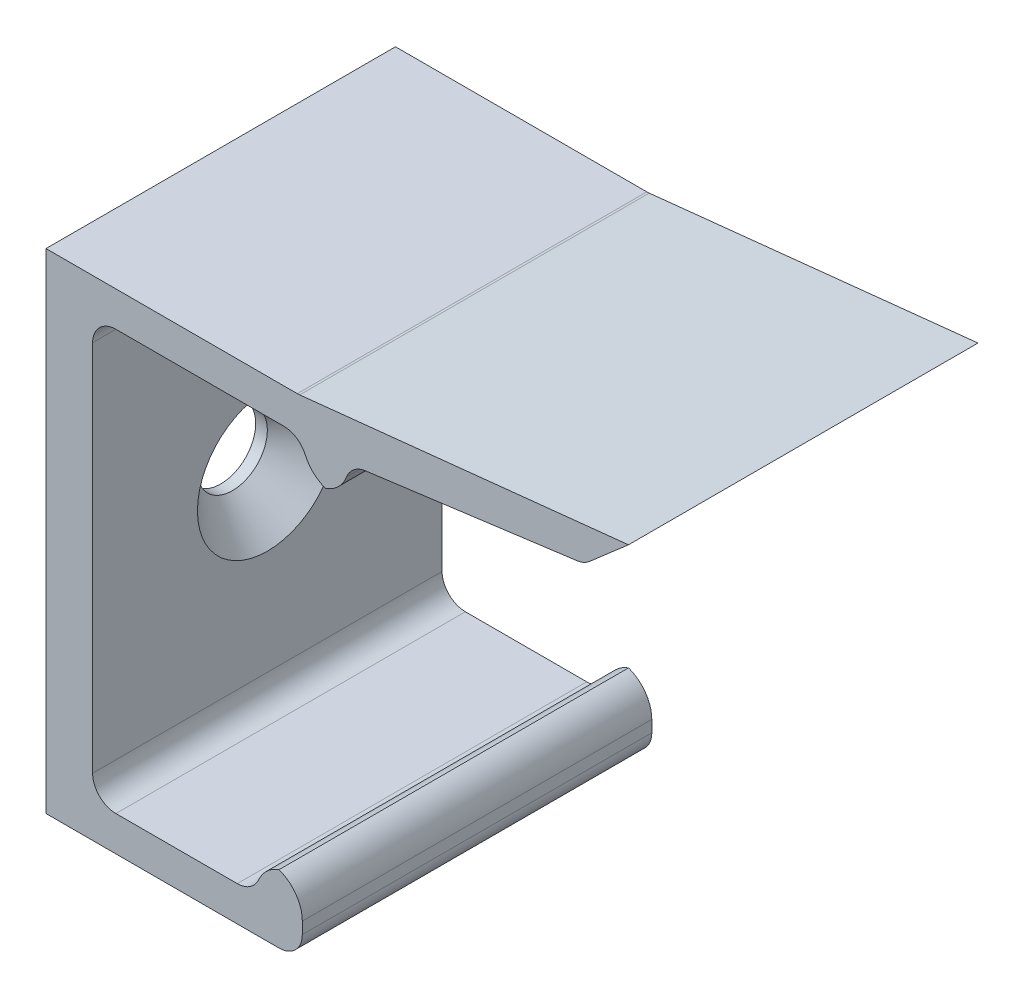
ISO-10303-21;
HEADER;
FILE_DESCRIPTION(('STEP AP214'),'2;1');
FILE_NAME('part.step','',(''),(''),'','','');
FILE_SCHEMA(('AUTOMOTIVE_DESIGN { 1 0 10303 214 1 1 1 1 }'));
ENDSEC;
DATA;
#1=APPLICATION_CONTEXT('core data for automotive mechanical design processes');
#2=APPLICATION_PROTOCOL_DEFINITION('international standard','automotive_design',2000,#1);
#3=PRODUCT_CONTEXT('',#1,'mechanical');
#4=PRODUCT('Part','Part','',(#3));
#5=PRODUCT_RELATED_PRODUCT_CATEGORY('part','',(#4));
#6=PRODUCT_DEFINITION_FORMATION('','',#4);
#7=PRODUCT_DEFINITION_CONTEXT('part definition',#1,'design');
#8=PRODUCT_DEFINITION('design','',#6,#7);
#9=PRODUCT_DEFINITION_SHAPE('','',#8);
#10=(LENGTH_UNIT() NAMED_UNIT(*) SI_UNIT(.MILLI.,.METRE.));
#11=(NAMED_UNIT(*) PLANE_ANGLE_UNIT() SI_UNIT($,.RADIAN.));
#12=(NAMED_UNIT(*) SI_UNIT($,.STERADIAN.) SOLID_ANGLE_UNIT());
#13=UNCERTAINTY_MEASURE_WITH_UNIT(LENGTH_MEASURE(1.E-05),#10,'distance_accuracy_value','');
#14=(GEOMETRIC_REPRESENTATION_CONTEXT(3) GLOBAL_UNCERTAINTY_ASSIGNED_CONTEXT((#13)) GLOBAL_UNIT_ASSIGNED_CONTEXT((#10,
#11,#12)) REPRESENTATION_CONTEXT('',''));
#15=CARTESIAN_POINT('',(0.,0.,0.));
#16=DIRECTION('',(0.,0.,1.));
#17=DIRECTION('',(1.,0.,0.));
#18=AXIS2_PLACEMENT_3D('',#15,#16,#17);
#19=CARTESIAN_POINT('',(2.,1.5,15.));
#20=DIRECTION('',(-1.,0.,0.));
#21=DIRECTION('',(0.,-1.,0.));
#22=AXIS2_PLACEMENT_3D('',#19,#20,#21);
#23=PLANE('',#22);
#24=CARTESIAN_POINT('',(2.,10.,7.5));
#25=DIRECTION('',(-1.,0.,0.));
#26=DIRECTION('',(0.,-1.,0.));
#27=AXIS2_PLACEMENT_3D('',#24,#25,#26);
#28=CIRCLE('',#27,2.99999999999999);
#29=CARTESIAN_POINT('',(2.,7.00000000000001,7.5));
#30=VERTEX_POINT('',#29);
#31=EDGE_CURVE('E208',#30,#30,#28,.T.);
#32=ORIENTED_EDGE('',*,*,#31,.T.);
#33=EDGE_LOOP('',(#32));
#34=FACE_BOUND('',#33,.T.);
#35=DIRECTION('',(0.,1.,0.));
#36=VECTOR('',#35,1.);
#37=CARTESIAN_POINT('',(2.,1.5,15.));
#38=LINE('',#37,#36);
#39=CARTESIAN_POINT('',(2.,2.5,15.));
#40=VERTEX_POINT('',#39);
#41=CARTESIAN_POINT('',(2.,18.5,15.));
#42=VERTEX_POINT('',#41);
#43=EDGE_CURVE('E360',#40,#42,#38,.T.);
#44=ORIENTED_EDGE('',*,*,#43,.F.);
#45=DIRECTION('',(0.,0.,-1.));
#46=VECTOR('',#45,1.);
#47=CARTESIAN_POINT('',(2.,2.5,0.));
#48=LINE('',#47,#46);
#49=CARTESIAN_POINT('',(2.,2.5,0.));
#50=VERTEX_POINT('',#49);
#51=EDGE_CURVE('E268',#40,#50,#48,.T.);
#52=ORIENTED_EDGE('',*,*,#51,.T.);
#53=DIRECTION('',(0.,1.,0.));
#54=VECTOR('',#53,1.);
#55=CARTESIAN_POINT('',(2.,1.5,0.));
#56=LINE('',#55,#54);
#57=CARTESIAN_POINT('',(2.,18.5,0.));
#58=VERTEX_POINT('',#57);
#59=EDGE_CURVE('E339',#50,#58,#56,.T.);
#60=ORIENTED_EDGE('',*,*,#59,.T.);
#61=DIRECTION('',(0.,0.,-1.));
#62=VECTOR('',#61,1.);
#63=CARTESIAN_POINT('',(2.,18.5,15.));
#64=LINE('',#63,#62);
#65=EDGE_CURVE('E266',#58,#42,#64,.F.);
#66=ORIENTED_EDGE('',*,*,#65,.T.);
#67=EDGE_LOOP('',(#44,#52,#60,#66));
#68=FACE_BOUND('',#67,.T.);
#69=ADVANCED_FACE('F33',(#34,#68),#23,.F.);
#70=CARTESIAN_POINT('',(2.,19.5,15.));
#71=DIRECTION('',(0.,1.,0.));
#72=DIRECTION('',(0.,0.,1.));
#73=AXIS2_PLACEMENT_3D('',#70,#71,#72);
#74=PLANE('',#73);
#75=DIRECTION('',(1.,0.,0.));
#76=VECTOR('',#75,1.);
#77=CARTESIAN_POINT('',(2.,19.5,0.));
#78=LINE('',#77,#76);
#79=CARTESIAN_POINT('',(3.,19.5,0.));
#80=VERTEX_POINT('',#79);
#81=CARTESIAN_POINT('',(10.2087121525221,19.5,0.));
#82=VERTEX_POINT('',#81);
#83=EDGE_CURVE('E334',#80,#82,#78,.T.);
#84=ORIENTED_EDGE('',*,*,#83,.T.);
#85=DIRECTION('',(0.,0.,-1.));
#86=VECTOR('',#85,1.);
#87=CARTESIAN_POINT('',(10.2087121525221,19.5,15.));
#88=LINE('',#87,#86);
#89=CARTESIAN_POINT('',(10.2087121525221,19.5,15.));
#90=VERTEX_POINT('',#89);
#91=EDGE_CURVE('E303',#82,#90,#88,.F.);
#92=ORIENTED_EDGE('',*,*,#91,.T.);
#93=DIRECTION('',(1.,0.,0.));
#94=VECTOR('',#93,1.);
#95=CARTESIAN_POINT('',(2.,19.5,15.));
#96=LINE('',#95,#94);
#97=CARTESIAN_POINT('',(3.,19.5,15.));
#98=VERTEX_POINT('',#97);
#99=EDGE_CURVE('E321',#98,#90,#96,.T.);
#100=ORIENTED_EDGE('',*,*,#99,.F.);
#101=DIRECTION('',(0.,0.,-1.));
#102=VECTOR('',#101,1.);
#103=CARTESIAN_POINT('',(3.,19.5,0.));
#104=LINE('',#103,#102);
#105=EDGE_CURVE('E274',#98,#80,#104,.T.);
#106=ORIENTED_EDGE('',*,*,#105,.T.);
#107=EDGE_LOOP('',(#84,#92,#100,#106));
#108=FACE_BOUND('',#107,.T.);
#109=ADVANCED_FACE('F336',(#108),#74,.F.);
#110=CARTESIAN_POINT('',(13.,19.5,15.));
#111=DIRECTION('',(-0.130853953425096,0.991401655673937,0.));
#112=DIRECTION('',(-0.991401655673937,-0.130853953425096,0.));
#113=AXIS2_PLACEMENT_3D('',#110,#111,#112);
#114=PLANE('',#113);
#115=DIRECTION('',(0.991401655673937,0.130853953425096,0.));
#116=VECTOR('',#115,1.);
#117=CARTESIAN_POINT('',(13.,19.5,15.));
#118=LINE('',#117,#116);
#119=CARTESIAN_POINT('',(13.7020110590844,19.59265762459,15.));
#120=VERTEX_POINT('',#119);
#121=CARTESIAN_POINT('',(22.7966760393131,20.7930518955989,15.));
#122=VERTEX_POINT('',#121);
#123=EDGE_CURVE('E193',#120,#122,#118,.T.);
#124=ORIENTED_EDGE('',*,*,#123,.F.);
#125=DIRECTION('',(0.,0.,-1.));
#126=VECTOR('',#125,1.);
#127=CARTESIAN_POINT('',(13.7020110590844,19.59265762459,15.));
#128=LINE('',#127,#126);
#129=CARTESIAN_POINT('',(13.7020110590844,19.59265762459,0.));
#130=VERTEX_POINT('',#129);
#131=EDGE_CURVE('E295',#120,#130,#128,.T.);
#132=ORIENTED_EDGE('',*,*,#131,.T.);
#133=DIRECTION('',(0.991401655673937,0.130853953425096,0.));
#134=VECTOR('',#133,1.);
#135=CARTESIAN_POINT('',(13.,19.5,0.));
#136=LINE('',#135,#134);
#137=CARTESIAN_POINT('',(22.7966760393131,20.7930518955989,0.));
#138=VERTEX_POINT('',#137);
#139=EDGE_CURVE('E338',#130,#138,#136,.T.);
#140=ORIENTED_EDGE('',*,*,#139,.T.);
#141=DIRECTION('',(0.,0.,-1.));
#142=VECTOR('',#141,1.);
#143=CARTESIAN_POINT('',(22.7966760393131,20.7930518955989,15.));
#144=LINE('',#143,#142);
#145=EDGE_CURVE('E279',#138,#122,#144,.F.);
#146=ORIENTED_EDGE('',*,*,#145,.T.);
#147=EDGE_LOOP('',(#124,#132,#140,#146));
#148=FACE_BOUND('',#147,.T.);
#149=ADVANCED_FACE('F407',(#148),#114,.F.);
#150=CARTESIAN_POINT('',(23.0948753583367,20.8324108774803,15.));
#151=DIRECTION('',(-0.656059028990508,0.754709580222771,0.));
#152=DIRECTION('',(-0.754709580222771,-0.656059028990508,0.));
#153=AXIS2_PLACEMENT_3D('',#150,#151,#152);
#154=PLANE('',#153);
#155=DIRECTION('',(0.754709580222771,0.656059028990508,0.));
#156=VECTOR('',#155,1.);
#157=CARTESIAN_POINT('',(23.0948753583367,20.8324108774803,15.));
#158=LINE('',#157,#156);
#159=CARTESIAN_POINT('',(23.3218811148785,21.02974397105,15.));
#160=VERTEX_POINT('',#159);
#161=CARTESIAN_POINT('',(25.,22.4885104623651,15.));
#162=VERTEX_POINT('',#161);
#163=EDGE_CURVE('E181',#160,#162,#158,.T.);
#164=ORIENTED_EDGE('',*,*,#163,.F.);
#165=DIRECTION('',(0.,0.,-1.));
#166=VECTOR('',#165,1.);
#167=CARTESIAN_POINT('',(23.3218811148785,21.02974397105,15.));
#168=LINE('',#167,#166);
#169=CARTESIAN_POINT('',(23.3218811148785,21.02974397105,0.));
#170=VERTEX_POINT('',#169);
#171=EDGE_CURVE('E277',#160,#170,#168,.T.);
#172=ORIENTED_EDGE('',*,*,#171,.T.);
#173=DIRECTION('',(0.754709580222771,0.656059028990508,0.));
#174=VECTOR('',#173,1.);
#175=CARTESIAN_POINT('',(23.0948753583367,20.8324108774803,0.));
#176=LINE('',#175,#174);
#177=CARTESIAN_POINT('',(25.,22.4885104623651,0.));
#178=VERTEX_POINT('',#177);
#179=EDGE_CURVE('E206',#170,#178,#176,.T.);
#180=ORIENTED_EDGE('',*,*,#179,.T.);
#181=DIRECTION('',(0.,0.,-1.));
#182=VECTOR('',#181,1.);
#183=CARTESIAN_POINT('',(25.,22.4885104623651,15.));
#184=LINE('',#183,#182);
#185=EDGE_CURVE('E199',#162,#178,#184,.T.);
#186=ORIENTED_EDGE('',*,*,#185,.F.);
#187=EDGE_LOOP('',(#164,#172,#180,#186));
#188=FACE_BOUND('',#187,.T.);
#189=ADVANCED_FACE('F204',(#188),#154,.F.);
#190=CARTESIAN_POINT('',(10.8377689671354,21.,15.));
#191=DIRECTION('',(-0.104528463267654,0.994521895368273,0.));
#192=DIRECTION('',(-0.994521895368273,-0.104528463267654,0.));
#193=AXIS2_PLACEMENT_3D('',#190,#191,#192);
#194=PLANE('',#193);
#195=DIRECTION('',(0.994521895368273,0.104528463267654,0.));
#196=VECTOR('',#195,1.);
#197=CARTESIAN_POINT('',(10.8377689671354,21.,0.));
#198=LINE('',#197,#196);
#199=CARTESIAN_POINT('',(10.88988965112,21.0054781046317,0.));
#200=VERTEX_POINT('',#199);
#201=EDGE_CURVE('E347',#200,#178,#198,.T.);
#202=ORIENTED_EDGE('',*,*,#201,.F.);
#203=DIRECTION('',(0.,0.,-1.));
#204=VECTOR('',#203,1.);
#205=CARTESIAN_POINT('',(10.88988965112,21.0054781046317,15.));
#206=LINE('',#205,#204);
#207=CARTESIAN_POINT('',(10.88988965112,21.0054781046317,15.));
#208=VERTEX_POINT('',#207);
#209=EDGE_CURVE('E201',#200,#208,#206,.F.);
#210=ORIENTED_EDGE('',*,*,#209,.T.);
#211=DIRECTION('',(0.994521895368273,0.104528463267654,0.));
#212=VECTOR('',#211,1.);
#213=CARTESIAN_POINT('',(10.8377689671354,21.,15.));
#214=LINE('',#213,#212);
#215=EDGE_CURVE('E185',#208,#162,#214,.T.);
#216=ORIENTED_EDGE('',*,*,#215,.T.);
#217=ORIENTED_EDGE('',*,*,#185,.T.);
#218=EDGE_LOOP('',(#202,#210,#216,#217));
#219=FACE_BOUND('',#218,.T.);
#220=ADVANCED_FACE('F198',(#219),#194,.T.);
#221=CARTESIAN_POINT('',(0.,21.,15.));
#222=DIRECTION('',(0.,1.,0.));
#223=DIRECTION('',(0.,0.,1.));
#224=AXIS2_PLACEMENT_3D('',#221,#222,#223);
#225=PLANE('',#224);
#226=DIRECTION('',(1.,0.,0.));
#227=VECTOR('',#226,1.);
#228=CARTESIAN_POINT('',(0.,21.,15.));
#229=LINE('',#228,#227);
#230=CARTESIAN_POINT('',(0.,21.,15.));
#231=VERTEX_POINT('',#230);
#232=CARTESIAN_POINT('',(10.7853611878524,21.,15.));
#233=VERTEX_POINT('',#232);
#234=EDGE_CURVE('E202',#231,#233,#229,.T.);
#235=ORIENTED_EDGE('',*,*,#234,.T.);
#236=DIRECTION('',(0.,0.,-1.));
#237=VECTOR('',#236,1.);
#238=CARTESIAN_POINT('',(10.7853611878524,21.,0.));
#239=LINE('',#238,#237);
#240=CARTESIAN_POINT('',(10.7853611878524,21.,0.));
#241=VERTEX_POINT('',#240);
#242=EDGE_CURVE('E242',#233,#241,#239,.T.);
#243=ORIENTED_EDGE('',*,*,#242,.T.);
#244=DIRECTION('',(1.,0.,0.));
#245=VECTOR('',#244,1.);
#246=CARTESIAN_POINT('',(0.,21.,0.));
#247=LINE('',#246,#245);
#248=CARTESIAN_POINT('',(0.,21.,0.));
#249=VERTEX_POINT('',#248);
#250=EDGE_CURVE('E349',#249,#241,#247,.T.);
#251=ORIENTED_EDGE('',*,*,#250,.F.);
#252=DIRECTION('',(0.,0.,-1.));
#253=VECTOR('',#252,1.);
#254=CARTESIAN_POINT('',(0.,21.,15.));
#255=LINE('',#254,#253);
#256=EDGE_CURVE('E209',#231,#249,#255,.T.);
#257=ORIENTED_EDGE('',*,*,#256,.F.);
#258=EDGE_LOOP('',(#235,#243,#251,#257));
#259=FACE_BOUND('',#258,.T.);
#260=ADVANCED_FACE('F480',(#259),#225,.T.);
#261=CARTESIAN_POINT('',(0.,21.,15.));
#262=DIRECTION('',(1.,0.,0.));
#263=DIRECTION('',(0.,1.,0.));
#264=AXIS2_PLACEMENT_3D('',#261,#262,#263);
#265=PLANE('',#264);
#266=CARTESIAN_POINT('',(0.,10.,7.5));
#267=DIRECTION('',(1.,0.,0.));
#268=DIRECTION('',(0.,1.,0.));
#269=AXIS2_PLACEMENT_3D('',#266,#267,#268);
#270=CIRCLE('',#269,1.5);
#271=CARTESIAN_POINT('',(0.,11.5,7.5));
#272=VERTEX_POINT('',#271);
#273=EDGE_CURVE('E246',#272,#272,#270,.T.);
#274=ORIENTED_EDGE('',*,*,#273,.T.);
#275=EDGE_LOOP('',(#274));
#276=FACE_BOUND('',#275,.T.);
#277=DIRECTION('',(0.,-1.,0.));
#278=VECTOR('',#277,1.);
#279=CARTESIAN_POINT('',(0.,21.,0.));
#280=LINE('',#279,#278);
#281=CARTESIAN_POINT('',(0.,0.,0.));
#282=VERTEX_POINT('',#281);
#283=EDGE_CURVE('E352',#249,#282,#280,.T.);
#284=ORIENTED_EDGE('',*,*,#283,.T.);
#285=DIRECTION('',(0.,0.,-1.));
#286=VECTOR('',#285,1.);
#287=CARTESIAN_POINT('',(0.,0.,15.));
#288=LINE('',#287,#286);
#289=CARTESIAN_POINT('',(0.,0.,15.));
#290=VERTEX_POINT('',#289);
#291=EDGE_CURVE('E214',#290,#282,#288,.T.);
#292=ORIENTED_EDGE('',*,*,#291,.F.);
#293=DIRECTION('',(0.,-1.,0.));
#294=VECTOR('',#293,1.);
#295=CARTESIAN_POINT('',(0.,21.,15.));
#296=LINE('',#295,#294);
#297=EDGE_CURVE('E373',#231,#290,#296,.T.);
#298=ORIENTED_EDGE('',*,*,#297,.F.);
#299=ORIENTED_EDGE('',*,*,#256,.T.);
#300=EDGE_LOOP('',(#284,#292,#298,#299));
#301=FACE_BOUND('',#300,.T.);
#302=ADVANCED_FACE('F384',(#276,#301),#265,.F.);
#303=CARTESIAN_POINT('',(0.,0.,15.));
#304=DIRECTION('',(0.,1.,0.));
#305=DIRECTION('',(0.,0.,1.));
#306=AXIS2_PLACEMENT_3D('',#303,#304,#305);
#307=PLANE('',#306);
#308=DIRECTION('',(1.,0.,0.));
#309=VECTOR('',#308,1.);
#310=CARTESIAN_POINT('',(0.,0.,0.));
#311=LINE('',#310,#309);
#312=CARTESIAN_POINT('',(9.99999999999999,0.,0.));
#313=VERTEX_POINT('',#312);
#314=EDGE_CURVE('E354',#282,#313,#311,.T.);
#315=ORIENTED_EDGE('',*,*,#314,.T.);
#316=DIRECTION('',(0.,0.,-1.));
#317=VECTOR('',#316,1.);
#318=CARTESIAN_POINT('',(9.99999999999999,0.,15.));
#319=LINE('',#318,#317);
#320=CARTESIAN_POINT('',(9.99999999999999,0.,15.));
#321=VERTEX_POINT('',#320);
#322=EDGE_CURVE('E261',#313,#321,#319,.F.);
#323=ORIENTED_EDGE('',*,*,#322,.T.);
#324=DIRECTION('',(1.,0.,0.));
#325=VECTOR('',#324,1.);
#326=CARTESIAN_POINT('',(0.,0.,15.));
#327=LINE('',#326,#325);
#328=EDGE_CURVE('E369',#290,#321,#327,.T.);
#329=ORIENTED_EDGE('',*,*,#328,.F.);
#330=ORIENTED_EDGE('',*,*,#291,.T.);
#331=EDGE_LOOP('',(#315,#323,#329,#330));
#332=FACE_BOUND('',#331,.T.);
#333=ADVANCED_FACE('F472',(#332),#307,.F.);
#334=CARTESIAN_POINT('',(11.,0.,15.));
#335=DIRECTION('',(-1.,0.,0.));
#336=DIRECTION('',(0.,-1.,0.));
#337=AXIS2_PLACEMENT_3D('',#334,#335,#336);
#338=PLANE('',#337);
#339=DIRECTION('',(0.,1.,0.));
#340=VECTOR('',#339,1.);
#341=CARTESIAN_POINT('',(11.,0.,15.));
#342=LINE('',#341,#340);
#343=CARTESIAN_POINT('',(11.,1.,15.));
#344=VERTEX_POINT('',#343);
#345=CARTESIAN_POINT('',(11.,1.5,15.));
#346=VERTEX_POINT('',#345);
#347=EDGE_CURVE('E367',#344,#346,#342,.T.);
#348=ORIENTED_EDGE('',*,*,#347,.F.);
#349=DIRECTION('',(0.,0.,-1.));
#350=VECTOR('',#349,1.);
#351=CARTESIAN_POINT('',(11.,1.,15.));
#352=LINE('',#351,#350);
#353=CARTESIAN_POINT('',(11.,1.,0.));
#354=VERTEX_POINT('',#353);
#355=EDGE_CURVE('E253',#344,#354,#352,.T.);
#356=ORIENTED_EDGE('',*,*,#355,.T.);
#357=DIRECTION('',(0.,1.,0.));
#358=VECTOR('',#357,1.);
#359=CARTESIAN_POINT('',(11.,0.,0.));
#360=LINE('',#359,#358);
#361=CARTESIAN_POINT('',(11.,1.5,0.));
#362=VERTEX_POINT('',#361);
#363=EDGE_CURVE('E357',#354,#362,#360,.T.);
#364=ORIENTED_EDGE('',*,*,#363,.T.);
#365=DIRECTION('',(0.,0.,-1.));
#366=VECTOR('',#365,1.);
#367=CARTESIAN_POINT('',(11.,1.5,15.));
#368=LINE('',#367,#366);
#369=EDGE_CURVE('E239',#362,#346,#368,.F.);
#370=ORIENTED_EDGE('',*,*,#369,.T.);
#371=EDGE_LOOP('',(#348,#356,#364,#370));
#372=FACE_BOUND('',#371,.T.);
#373=ADVANCED_FACE('F466',(#372),#338,.F.);
#374=CARTESIAN_POINT('',(9.,1.5,15.));
#375=DIRECTION('',(0.,-1.,0.));
#376=DIRECTION('',(1.,0.,0.));
#377=AXIS2_PLACEMENT_3D('',#374,#375,#376);
#378=PLANE('',#377);
#379=DIRECTION('',(-1.,0.,0.));
#380=VECTOR('',#379,1.);
#381=CARTESIAN_POINT('',(9.,1.5,15.));
#382=LINE('',#381,#380);
#383=CARTESIAN_POINT('',(8.20871215252208,1.5,15.));
#384=VERTEX_POINT('',#383);
#385=CARTESIAN_POINT('',(3.,1.5,15.));
#386=VERTEX_POINT('',#385);
#387=EDGE_CURVE('E362',#384,#386,#382,.T.);
#388=ORIENTED_EDGE('',*,*,#387,.F.);
#389=DIRECTION('',(0.,0.,-1.));
#390=VECTOR('',#389,1.);
#391=CARTESIAN_POINT('',(8.20871215252208,1.5,15.));
#392=LINE('',#391,#390);
#393=CARTESIAN_POINT('',(8.20871215252208,1.5,0.));
#394=VERTEX_POINT('',#393);
#395=EDGE_CURVE('E305',#384,#394,#392,.T.);
#396=ORIENTED_EDGE('',*,*,#395,.T.);
#397=DIRECTION('',(-1.,0.,0.));
#398=VECTOR('',#397,1.);
#399=CARTESIAN_POINT('',(9.,1.5,0.));
#400=LINE('',#399,#398);
#401=CARTESIAN_POINT('',(3.,1.5,0.));
#402=VERTEX_POINT('',#401);
#403=EDGE_CURVE('E359',#394,#402,#400,.T.);
#404=ORIENTED_EDGE('',*,*,#403,.T.);
#405=DIRECTION('',(0.,0.,-1.));
#406=VECTOR('',#405,1.);
#407=CARTESIAN_POINT('',(3.,1.5,15.));
#408=LINE('',#407,#406);
#409=EDGE_CURVE('E271',#402,#386,#408,.F.);
#410=ORIENTED_EDGE('',*,*,#409,.T.);
#411=EDGE_LOOP('',(#388,#396,#404,#410));
#412=FACE_BOUND('',#411,.T.);
#413=ADVANCED_FACE('F457',(#412),#378,.F.);
#414=CARTESIAN_POINT('',(0.,0.,15.));
#415=DIRECTION('',(0.,0.,-1.));
#416=DIRECTION('',(-1.,0.,0.));
#417=AXIS2_PLACEMENT_3D('',#414,#415,#416);
#418=PLANE('',#417);
#419=ORIENTED_EDGE('',*,*,#328,.T.);
#420=CARTESIAN_POINT('',(9.99999999999999,1.,15.));
#421=DIRECTION('',(0.,0.,-1.));
#422=DIRECTION('',(-1.,0.,0.));
#423=AXIS2_PLACEMENT_3D('',#420,#421,#422);
#424=CIRCLE('',#423,1.);
#425=EDGE_CURVE('E264',#321,#344,#424,.F.);
#426=ORIENTED_EDGE('',*,*,#425,.T.);
#427=ORIENTED_EDGE('',*,*,#347,.T.);
#428=CARTESIAN_POINT('',(9.49999999999999,1.5,15.));
#429=DIRECTION('',(0.,0.,-1.));
#430=DIRECTION('',(-1.,0.,0.));
#431=AXIS2_PLACEMENT_3D('',#428,#429,#430);
#432=CIRCLE('',#431,1.5);
#433=CARTESIAN_POINT('',(9.99999999999999,2.91421356237309,15.));
#434=VERTEX_POINT('',#433);
#435=EDGE_CURVE('E235',#346,#434,#432,.F.);
#436=ORIENTED_EDGE('',*,*,#435,.T.);
#437=CARTESIAN_POINT('',(10.5,1.5,15.));
#438=DIRECTION('',(0.,0.,-1.));
#439=DIRECTION('',(-1.,0.,0.));
#440=AXIS2_PLACEMENT_3D('',#437,#438,#439);
#441=CIRCLE('',#440,1.5);
#442=CARTESIAN_POINT('',(9.12522729151324,2.1,15.));
#443=VERTEX_POINT('',#442);
#444=EDGE_CURVE('E237',#434,#443,#441,.F.);
#445=ORIENTED_EDGE('',*,*,#444,.T.);
#446=CARTESIAN_POINT('',(8.20871215252208,2.5,15.));
#447=DIRECTION('',(0.,0.,-1.));
#448=DIRECTION('',(-1.,0.,0.));
#449=AXIS2_PLACEMENT_3D('',#446,#447,#448);
#450=CIRCLE('',#449,1.);
#451=EDGE_CURVE('E11',#443,#384,#450,.T.);
#452=ORIENTED_EDGE('',*,*,#451,.T.);
#453=ORIENTED_EDGE('',*,*,#387,.T.);
#454=CARTESIAN_POINT('',(3.,2.5,15.));
#455=DIRECTION('',(0.,0.,-1.));
#456=DIRECTION('',(-1.,0.,0.));
#457=AXIS2_PLACEMENT_3D('',#454,#455,#456);
#458=CIRCLE('',#457,1.);
#459=EDGE_CURVE('E289',#386,#40,#458,.T.);
#460=ORIENTED_EDGE('',*,*,#459,.T.);
#461=ORIENTED_EDGE('',*,*,#43,.T.);
#462=CARTESIAN_POINT('',(3.,18.5,15.));
#463=DIRECTION('',(0.,0.,-1.));
#464=DIRECTION('',(-1.,0.,0.));
#465=AXIS2_PLACEMENT_3D('',#462,#463,#464);
#466=CIRCLE('',#465,1.);
#467=EDGE_CURVE('E293',#42,#98,#466,.T.);
#468=ORIENTED_EDGE('',*,*,#467,.T.);
#469=ORIENTED_EDGE('',*,*,#99,.T.);
#470=CARTESIAN_POINT('',(10.2087121525221,18.5,15.));
#471=DIRECTION('',(0.,0.,-1.));
#472=DIRECTION('',(-1.,0.,0.));
#473=AXIS2_PLACEMENT_3D('',#470,#471,#472);
#474=CIRCLE('',#473,1.);
#475=CARTESIAN_POINT('',(11.1252272915133,18.9,15.));
#476=VERTEX_POINT('',#475);
#477=EDGE_CURVE('E315',#90,#476,#474,.T.);
#478=ORIENTED_EDGE('',*,*,#477,.T.);
#479=CARTESIAN_POINT('',(12.5,19.5,15.));
#480=DIRECTION('',(0.,0.,-1.));
#481=DIRECTION('',(-1.,0.,0.));
#482=AXIS2_PLACEMENT_3D('',#479,#480,#481);
#483=CIRCLE('',#482,1.5);
#484=CARTESIAN_POINT('',(12.,18.0857864376269,15.));
#485=VERTEX_POINT('',#484);
#486=EDGE_CURVE('E230',#476,#485,#483,.F.);
#487=ORIENTED_EDGE('',*,*,#486,.T.);
#488=CARTESIAN_POINT('',(11.5,19.5,15.));
#489=DIRECTION('',(0.,0.,-1.));
#490=DIRECTION('',(-1.,0.,0.));
#491=AXIS2_PLACEMENT_3D('',#488,#489,#490);
#492=CIRCLE('',#491,1.5);
#493=CARTESIAN_POINT('',(12.8997190075057,18.9607535813496,15.));
#494=VERTEX_POINT('',#493);
#495=EDGE_CURVE('E232',#485,#494,#492,.F.);
#496=ORIENTED_EDGE('',*,*,#495,.T.);
#497=CARTESIAN_POINT('',(13.8328650125095,18.6012559689161,15.));
#498=DIRECTION('',(0.,0.,-1.));
#499=DIRECTION('',(-1.,0.,0.));
#500=AXIS2_PLACEMENT_3D('',#497,#498,#499);
#501=CIRCLE('',#500,1.);
#502=EDGE_CURVE('E311',#494,#120,#501,.T.);
#503=ORIENTED_EDGE('',*,*,#502,.T.);
#504=ORIENTED_EDGE('',*,*,#123,.T.);
#505=CARTESIAN_POINT('',(22.665822085888,21.7844535512728,15.));
#506=DIRECTION('',(0.,0.,-1.));
#507=DIRECTION('',(-1.,0.,0.));
#508=AXIS2_PLACEMENT_3D('',#505,#506,#507);
#509=CIRCLE('',#508,1.);
#510=EDGE_CURVE('E188',#122,#160,#509,.F.);
#511=ORIENTED_EDGE('',*,*,#510,.T.);
#512=ORIENTED_EDGE('',*,*,#163,.T.);
#513=ORIENTED_EDGE('',*,*,#215,.F.);
#514=CARTESIAN_POINT('',(10.7853611878524,22.,15.));
#515=DIRECTION('',(0.,0.,-1.));
#516=DIRECTION('',(-1.,0.,0.));
#517=AXIS2_PLACEMENT_3D('',#514,#515,#516);
#518=CIRCLE('',#517,1.);
#519=EDGE_CURVE('E284',#208,#233,#518,.T.);
#520=ORIENTED_EDGE('',*,*,#519,.T.);
#521=ORIENTED_EDGE('',*,*,#234,.F.);
#522=ORIENTED_EDGE('',*,*,#297,.T.);
#523=EDGE_LOOP('',(#419,#426,#427,#436,#445,#452,#453,#460,#461,#468,#469,#478,#487,#496,#503,
#504,#511,#512,#513,#520,#521,#522));
#524=FACE_BOUND('',#523,.T.);
#525=ADVANCED_FACE('F184',(#524),#418,.F.);
#526=CARTESIAN_POINT('',(0.,0.,0.));
#527=DIRECTION('',(0.,0.,-1.));
#528=DIRECTION('',(-1.,0.,0.));
#529=AXIS2_PLACEMENT_3D('',#526,#527,#528);
#530=PLANE('',#529);
#531=ORIENTED_EDGE('',*,*,#363,.F.);
#532=CARTESIAN_POINT('',(9.99999999999999,1.,0.));
#533=DIRECTION('',(0.,0.,-1.));
#534=DIRECTION('',(-1.,0.,0.));
#535=AXIS2_PLACEMENT_3D('',#532,#533,#534);
#536=CIRCLE('',#535,1.);
#537=EDGE_CURVE('E259',#354,#313,#536,.T.);
#538=ORIENTED_EDGE('',*,*,#537,.T.);
#539=ORIENTED_EDGE('',*,*,#314,.F.);
#540=ORIENTED_EDGE('',*,*,#283,.F.);
#541=ORIENTED_EDGE('',*,*,#250,.T.);
#542=CARTESIAN_POINT('',(10.7853611878524,22.,0.));
#543=DIRECTION('',(0.,0.,-1.));
#544=DIRECTION('',(-1.,0.,0.));
#545=AXIS2_PLACEMENT_3D('',#542,#543,#544);
#546=CIRCLE('',#545,1.);
#547=EDGE_CURVE('E282',#241,#200,#546,.F.);
#548=ORIENTED_EDGE('',*,*,#547,.T.);
#549=ORIENTED_EDGE('',*,*,#201,.T.);
#550=ORIENTED_EDGE('',*,*,#179,.F.);
#551=CARTESIAN_POINT('',(22.665822085888,21.7844535512728,0.));
#552=DIRECTION('',(0.,0.,-1.));
#553=DIRECTION('',(-1.,0.,0.));
#554=AXIS2_PLACEMENT_3D('',#551,#552,#553);
#555=CIRCLE('',#554,1.);
#556=EDGE_CURVE('E256',#170,#138,#555,.T.);
#557=ORIENTED_EDGE('',*,*,#556,.T.);
#558=ORIENTED_EDGE('',*,*,#139,.F.);
#559=CARTESIAN_POINT('',(13.8328650125095,18.6012559689161,0.));
#560=DIRECTION('',(0.,0.,-1.));
#561=DIRECTION('',(-1.,0.,0.));
#562=AXIS2_PLACEMENT_3D('',#559,#560,#561);
#563=CIRCLE('',#562,1.);
#564=CARTESIAN_POINT('',(12.8997190075057,18.9607535813496,0.));
#565=VERTEX_POINT('',#564);
#566=EDGE_CURVE('E309',#130,#565,#563,.F.);
#567=ORIENTED_EDGE('',*,*,#566,.T.);
#568=CARTESIAN_POINT('',(11.5,19.5,0.));
#569=DIRECTION('',(0.,0.,-1.));
#570=DIRECTION('',(-1.,0.,0.));
#571=AXIS2_PLACEMENT_3D('',#568,#569,#570);
#572=CIRCLE('',#571,1.5);
#573=CARTESIAN_POINT('',(12.,18.0857864376269,0.));
#574=VERTEX_POINT('',#573);
#575=EDGE_CURVE('E223',#565,#574,#572,.T.);
#576=ORIENTED_EDGE('',*,*,#575,.T.);
#577=CARTESIAN_POINT('',(12.5,19.5,0.));
#578=DIRECTION('',(0.,0.,-1.));
#579=DIRECTION('',(-1.,0.,0.));
#580=AXIS2_PLACEMENT_3D('',#577,#578,#579);
#581=CIRCLE('',#580,1.5);
#582=CARTESIAN_POINT('',(11.1252272915133,18.9,0.));
#583=VERTEX_POINT('',#582);
#584=EDGE_CURVE('E220',#574,#583,#581,.T.);
#585=ORIENTED_EDGE('',*,*,#584,.T.);
#586=CARTESIAN_POINT('',(10.2087121525221,18.5,0.));
#587=DIRECTION('',(0.,0.,-1.));
#588=DIRECTION('',(-1.,0.,0.));
#589=AXIS2_PLACEMENT_3D('',#586,#587,#588);
#590=CIRCLE('',#589,1.);
#591=EDGE_CURVE('E313',#583,#82,#590,.F.);
#592=ORIENTED_EDGE('',*,*,#591,.T.);
#593=ORIENTED_EDGE('',*,*,#83,.F.);
#594=CARTESIAN_POINT('',(3.,18.5,0.));
#595=DIRECTION('',(0.,0.,-1.));
#596=DIRECTION('',(-1.,0.,0.));
#597=AXIS2_PLACEMENT_3D('',#594,#595,#596);
#598=CIRCLE('',#597,1.);
#599=EDGE_CURVE('E291',#80,#58,#598,.F.);
#600=ORIENTED_EDGE('',*,*,#599,.T.);
#601=ORIENTED_EDGE('',*,*,#59,.F.);
#602=CARTESIAN_POINT('',(3.,2.5,0.));
#603=DIRECTION('',(0.,0.,-1.));
#604=DIRECTION('',(-1.,0.,0.));
#605=AXIS2_PLACEMENT_3D('',#602,#603,#604);
#606=CIRCLE('',#605,1.);
#607=EDGE_CURVE('E286',#50,#402,#606,.F.);
#608=ORIENTED_EDGE('',*,*,#607,.T.);
#609=ORIENTED_EDGE('',*,*,#403,.F.);
#610=CARTESIAN_POINT('',(8.20871215252208,2.5,0.));
#611=DIRECTION('',(0.,0.,-1.));
#612=DIRECTION('',(-1.,0.,0.));
#613=AXIS2_PLACEMENT_3D('',#610,#611,#612);
#614=CIRCLE('',#613,1.);
#615=CARTESIAN_POINT('',(9.12522729151324,2.1,0.));
#616=VERTEX_POINT('',#615);
#617=EDGE_CURVE('E41',#394,#616,#614,.F.);
#618=ORIENTED_EDGE('',*,*,#617,.T.);
#619=CARTESIAN_POINT('',(10.5,1.5,0.));
#620=DIRECTION('',(0.,0.,-1.));
#621=DIRECTION('',(-1.,0.,0.));
#622=AXIS2_PLACEMENT_3D('',#619,#620,#621);
#623=CIRCLE('',#622,1.5);
#624=CARTESIAN_POINT('',(9.99999999999999,2.91421356237309,0.));
#625=VERTEX_POINT('',#624);
#626=EDGE_CURVE('E228',#616,#625,#623,.T.);
#627=ORIENTED_EDGE('',*,*,#626,.T.);
#628=CARTESIAN_POINT('',(9.49999999999999,1.5,0.));
#629=DIRECTION('',(0.,0.,-1.));
#630=DIRECTION('',(-1.,0.,0.));
#631=AXIS2_PLACEMENT_3D('',#628,#629,#630);
#632=CIRCLE('',#631,1.5);
#633=EDGE_CURVE('E225',#625,#362,#632,.T.);
#634=ORIENTED_EDGE('',*,*,#633,.T.);
#635=EDGE_LOOP('',(#531,#538,#539,#540,#541,#548,#549,#550,#557,#558,#567,#576,#585,#592,#593,
#600,#601,#608,#609,#618,#627,#634));
#636=FACE_BOUND('',#635,.T.);
#637=ADVANCED_FACE('F333',(#636),#530,.T.);
#638=CARTESIAN_POINT('',(0.,10.,7.5));
#639=DIRECTION('',(1.,0.,0.));
#640=DIRECTION('',(0.,1.,0.));
#641=AXIS2_PLACEMENT_3D('',#638,#639,#640);
#642=CYLINDRICAL_SURFACE('',#641,1.5);
#643=CARTESIAN_POINT('',(0.500000000000007,10.,7.5));
#644=DIRECTION('',(-1.,0.,0.));
#645=DIRECTION('',(0.,0.,1.));
#646=AXIS2_PLACEMENT_3D('',#643,#644,#645);
#647=CIRCLE('',#646,1.5);
#648=CARTESIAN_POINT('',(0.500000000000007,10.,9.));
#649=VERTEX_POINT('',#648);
#650=EDGE_CURVE('E212',#649,#649,#647,.F.);
#651=ORIENTED_EDGE('',*,*,#650,.T.);
#652=EDGE_LOOP('',(#651));
#653=FACE_BOUND('',#652,.T.);
#654=ORIENTED_EDGE('',*,*,#273,.F.);
#655=EDGE_LOOP('',(#654));
#656=FACE_BOUND('',#655,.T.);
#657=ADVANCED_FACE('F387',(#653,#656),#642,.F.);
#658=CARTESIAN_POINT('',(2.,10.,7.5));
#659=DIRECTION('',(1.,0.,0.));
#660=DIRECTION('',(0.,0.,-1.));
#661=AXIS2_PLACEMENT_3D('',#658,#659,#660);
#662=CONICAL_SURFACE('',#661,2.99999999999999,0.785398163397446);
#663=ORIENTED_EDGE('',*,*,#650,.F.);
#664=EDGE_LOOP('',(#663));
#665=FACE_BOUND('',#664,.T.);
#666=ORIENTED_EDGE('',*,*,#31,.F.);
#667=EDGE_LOOP('',(#666));
#668=FACE_BOUND('',#667,.T.);
#669=ADVANCED_FACE('F389',(#665,#668),#662,.F.);
#670=CARTESIAN_POINT('',(9.49999999999999,1.5,15.));
#671=DIRECTION('',(0.,0.,-1.));
#672=DIRECTION('',(-1.,0.,0.));
#673=AXIS2_PLACEMENT_3D('',#670,#671,#672);
#674=CYLINDRICAL_SURFACE('',#673,1.5);
#675=DIRECTION('',(0.,0.,-1.));
#676=VECTOR('',#675,1.);
#677=CARTESIAN_POINT('',(9.99999999999999,2.91421356237309,7.5));
#678=LINE('',#677,#676);
#679=EDGE_CURVE('E243',#434,#625,#678,.T.);
#680=ORIENTED_EDGE('',*,*,#679,.F.);
#681=ORIENTED_EDGE('',*,*,#435,.F.);
#682=ORIENTED_EDGE('',*,*,#369,.F.);
#683=ORIENTED_EDGE('',*,*,#633,.F.);
#684=EDGE_LOOP('',(#680,#681,#682,#683));
#685=FACE_BOUND('',#684,.T.);
#686=ADVANCED_FACE('F396',(#685),#674,.T.);
#687=CARTESIAN_POINT('',(10.5,1.5,15.));
#688=DIRECTION('',(0.,0.,-1.));
#689=DIRECTION('',(-1.,0.,0.));
#690=AXIS2_PLACEMENT_3D('',#687,#688,#689);
#691=CYLINDRICAL_SURFACE('',#690,1.5);
#692=ORIENTED_EDGE('',*,*,#626,.F.);
#693=DIRECTION('',(0.,0.,-1.));
#694=VECTOR('',#693,1.);
#695=CARTESIAN_POINT('',(9.12522729151324,2.1,15.));
#696=LINE('',#695,#694);
#697=EDGE_CURVE('E54',#616,#443,#696,.F.);
#698=ORIENTED_EDGE('',*,*,#697,.T.);
#699=ORIENTED_EDGE('',*,*,#444,.F.);
#700=ORIENTED_EDGE('',*,*,#679,.T.);
#701=EDGE_LOOP('',(#692,#698,#699,#700));
#702=FACE_BOUND('',#701,.T.);
#703=ADVANCED_FACE('F412',(#702),#691,.T.);
#704=CARTESIAN_POINT('',(12.5,19.5,15.));
#705=DIRECTION('',(0.,0.,-1.));
#706=DIRECTION('',(-1.,0.,0.));
#707=AXIS2_PLACEMENT_3D('',#704,#705,#706);
#708=CYLINDRICAL_SURFACE('',#707,1.5);
#709=ORIENTED_EDGE('',*,*,#486,.F.);
#710=DIRECTION('',(0.,0.,-1.));
#711=VECTOR('',#710,1.);
#712=CARTESIAN_POINT('',(11.1252272915132,18.9,15.));
#713=LINE('',#712,#711);
#714=EDGE_CURVE('E300',#476,#583,#713,.T.);
#715=ORIENTED_EDGE('',*,*,#714,.T.);
#716=ORIENTED_EDGE('',*,*,#584,.F.);
#717=DIRECTION('',(0.,0.,-1.));
#718=VECTOR('',#717,1.);
#719=CARTESIAN_POINT('',(12.,18.0857864376269,7.5));
#720=LINE('',#719,#718);
#721=EDGE_CURVE('E247',#485,#574,#720,.T.);
#722=ORIENTED_EDGE('',*,*,#721,.F.);
#723=EDGE_LOOP('',(#709,#715,#716,#722));
#724=FACE_BOUND('',#723,.T.);
#725=ADVANCED_FACE('F326',(#724),#708,.T.);
#726=CARTESIAN_POINT('',(11.5,19.5,15.));
#727=DIRECTION('',(0.,0.,-1.));
#728=DIRECTION('',(-1.,0.,0.));
#729=AXIS2_PLACEMENT_3D('',#726,#727,#728);
#730=CYLINDRICAL_SURFACE('',#729,1.5);
#731=ORIENTED_EDGE('',*,*,#575,.F.);
#732=DIRECTION('',(0.,0.,-1.));
#733=VECTOR('',#732,1.);
#734=CARTESIAN_POINT('',(12.8997190075057,18.9607535813496,15.));
#735=LINE('',#734,#733);
#736=EDGE_CURVE('E298',#565,#494,#735,.F.);
#737=ORIENTED_EDGE('',*,*,#736,.T.);
#738=ORIENTED_EDGE('',*,*,#495,.F.);
#739=ORIENTED_EDGE('',*,*,#721,.T.);
#740=EDGE_LOOP('',(#731,#737,#738,#739));
#741=FACE_BOUND('',#740,.T.);
#742=ADVANCED_FACE('F418',(#741),#730,.T.);
#743=CARTESIAN_POINT('',(10.7853611878524,22.,15.));
#744=DIRECTION('',(0.,0.,1.));
#745=DIRECTION('',(1.,0.,0.));
#746=AXIS2_PLACEMENT_3D('',#743,#744,#745);
#747=CYLINDRICAL_SURFACE('',#746,1.);
#748=ORIENTED_EDGE('',*,*,#519,.F.);
#749=ORIENTED_EDGE('',*,*,#209,.F.);
#750=ORIENTED_EDGE('',*,*,#547,.F.);
#751=ORIENTED_EDGE('',*,*,#242,.F.);
#752=EDGE_LOOP('',(#748,#749,#750,#751));
#753=FACE_BOUND('',#752,.T.);
#754=ADVANCED_FACE('F421',(#753),#747,.F.);
#755=CARTESIAN_POINT('',(9.99999999999999,1.,15.));
#756=DIRECTION('',(0.,0.,-1.));
#757=DIRECTION('',(-1.,0.,0.));
#758=AXIS2_PLACEMENT_3D('',#755,#756,#757);
#759=CYLINDRICAL_SURFACE('',#758,1.);
#760=ORIENTED_EDGE('',*,*,#425,.F.);
#761=ORIENTED_EDGE('',*,*,#322,.F.);
#762=ORIENTED_EDGE('',*,*,#537,.F.);
#763=ORIENTED_EDGE('',*,*,#355,.F.);
#764=EDGE_LOOP('',(#760,#761,#762,#763));
#765=FACE_BOUND('',#764,.T.);
#766=ADVANCED_FACE('F427',(#765),#759,.T.);
#767=CARTESIAN_POINT('',(3.,2.5,15.));
#768=DIRECTION('',(0.,0.,1.));
#769=DIRECTION('',(1.,0.,0.));
#770=AXIS2_PLACEMENT_3D('',#767,#768,#769);
#771=CYLINDRICAL_SURFACE('',#770,1.);
#772=ORIENTED_EDGE('',*,*,#459,.F.);
#773=ORIENTED_EDGE('',*,*,#409,.F.);
#774=ORIENTED_EDGE('',*,*,#607,.F.);
#775=ORIENTED_EDGE('',*,*,#51,.F.);
#776=EDGE_LOOP('',(#772,#773,#774,#775));
#777=FACE_BOUND('',#776,.T.);
#778=ADVANCED_FACE('F431',(#777),#771,.F.);
#779=CARTESIAN_POINT('',(3.,18.5,15.));
#780=DIRECTION('',(0.,0.,1.));
#781=DIRECTION('',(1.,0.,0.));
#782=AXIS2_PLACEMENT_3D('',#779,#780,#781);
#783=CYLINDRICAL_SURFACE('',#782,1.);
#784=ORIENTED_EDGE('',*,*,#467,.F.);
#785=ORIENTED_EDGE('',*,*,#65,.F.);
#786=ORIENTED_EDGE('',*,*,#599,.F.);
#787=ORIENTED_EDGE('',*,*,#105,.F.);
#788=EDGE_LOOP('',(#784,#785,#786,#787));
#789=FACE_BOUND('',#788,.T.);
#790=ADVANCED_FACE('F435',(#789),#783,.F.);
#791=CARTESIAN_POINT('',(22.665822085888,21.7844535512728,15.));
#792=DIRECTION('',(0.,0.,-1.));
#793=DIRECTION('',(-1.,0.,0.));
#794=AXIS2_PLACEMENT_3D('',#791,#792,#793);
#795=CYLINDRICAL_SURFACE('',#794,1.);
#796=ORIENTED_EDGE('',*,*,#510,.F.);
#797=ORIENTED_EDGE('',*,*,#145,.F.);
#798=ORIENTED_EDGE('',*,*,#556,.F.);
#799=ORIENTED_EDGE('',*,*,#171,.F.);
#800=EDGE_LOOP('',(#796,#797,#798,#799));
#801=FACE_BOUND('',#800,.T.);
#802=ADVANCED_FACE('F439',(#801),#795,.T.);
#803=CARTESIAN_POINT('',(13.8328650125095,18.6012559689161,15.));
#804=DIRECTION('',(0.,0.,-1.));
#805=DIRECTION('',(-1.,0.,0.));
#806=AXIS2_PLACEMENT_3D('',#803,#804,#805);
#807=CYLINDRICAL_SURFACE('',#806,1.);
#808=ORIENTED_EDGE('',*,*,#502,.F.);
#809=ORIENTED_EDGE('',*,*,#736,.F.);
#810=ORIENTED_EDGE('',*,*,#566,.F.);
#811=ORIENTED_EDGE('',*,*,#131,.F.);
#812=EDGE_LOOP('',(#808,#809,#810,#811));
#813=FACE_BOUND('',#812,.T.);
#814=ADVANCED_FACE('F443',(#813),#807,.F.);
#815=CARTESIAN_POINT('',(10.2087121525221,18.5,15.));
#816=DIRECTION('',(0.,0.,-1.));
#817=DIRECTION('',(-1.,0.,0.));
#818=AXIS2_PLACEMENT_3D('',#815,#816,#817);
#819=CYLINDRICAL_SURFACE('',#818,1.);
#820=ORIENTED_EDGE('',*,*,#477,.F.);
#821=ORIENTED_EDGE('',*,*,#91,.F.);
#822=ORIENTED_EDGE('',*,*,#591,.F.);
#823=ORIENTED_EDGE('',*,*,#714,.F.);
#824=EDGE_LOOP('',(#820,#821,#822,#823));
#825=FACE_BOUND('',#824,.T.);
#826=ADVANCED_FACE('F329',(#825),#819,.F.);
#827=CARTESIAN_POINT('',(8.20871215252208,2.5,15.));
#828=DIRECTION('',(0.,0.,-1.));
#829=DIRECTION('',(-1.,0.,0.));
#830=AXIS2_PLACEMENT_3D('',#827,#828,#829);
#831=CYLINDRICAL_SURFACE('',#830,1.);
#832=ORIENTED_EDGE('',*,*,#451,.F.);
#833=ORIENTED_EDGE('',*,*,#697,.F.);
#834=ORIENTED_EDGE('',*,*,#617,.F.);
#835=ORIENTED_EDGE('',*,*,#395,.F.);
#836=EDGE_LOOP('',(#832,#833,#834,#835));
#837=FACE_BOUND('',#836,.T.);
#838=ADVANCED_FACE('F35',(#837),#831,.F.);
#839=CLOSED_SHELL('',(#69,#109,#149,#189,#220,#260,#302,#333,#373,#413,#525,#637,#657,#669,#686,
#703,#725,#742,#754,#766,#778,#790,#802,#814,#826,#838));
#840=MANIFOLD_SOLID_BREP('B2',#839);
#841=ADVANCED_BREP_SHAPE_REPRESENTATION('',(#18,#840),#14);
#842=SHAPE_DEFINITION_REPRESENTATION(#9,#841);
ENDSEC;
END-ISO-10303-21;
